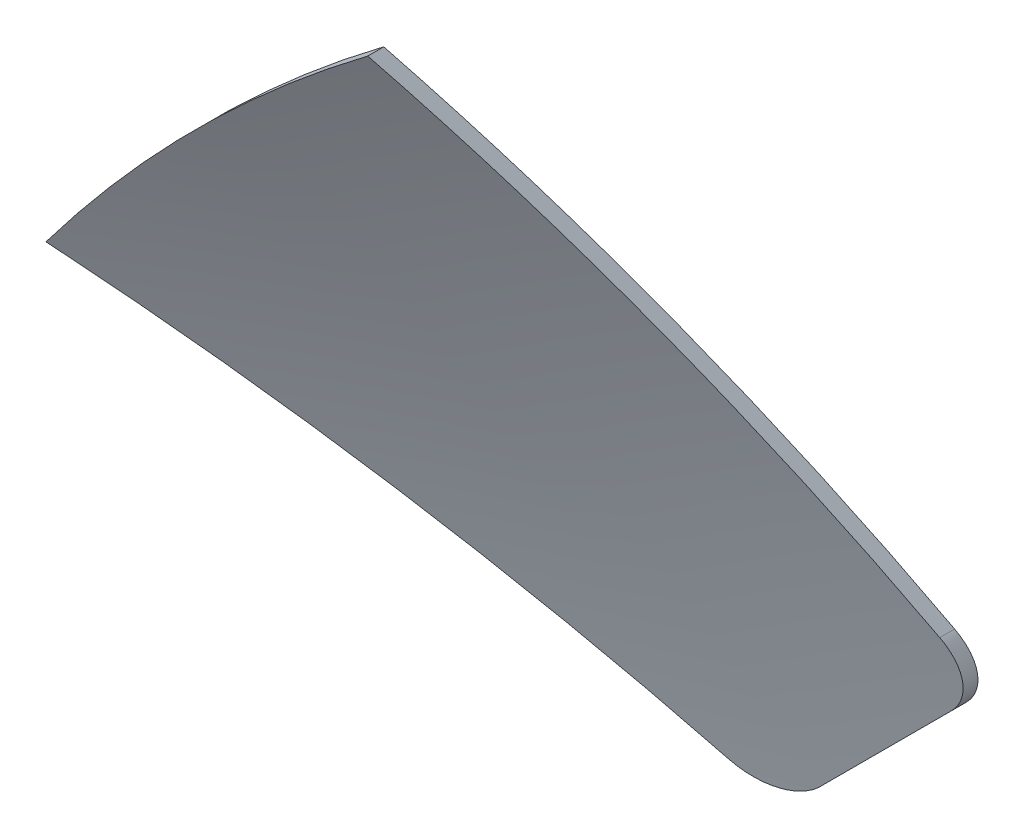
ISO-10303-21;
HEADER;
FILE_DESCRIPTION(('STEP AP214'),'2;1');
FILE_NAME('part.step','',(''),(''),'','','');
FILE_SCHEMA(('AUTOMOTIVE_DESIGN { 1 0 10303 214 1 1 1 1 }'));
ENDSEC;
DATA;
#1=APPLICATION_CONTEXT('core data for automotive mechanical design processes');
#2=APPLICATION_PROTOCOL_DEFINITION('international standard','automotive_design',2000,#1);
#3=PRODUCT_CONTEXT('',#1,'mechanical');
#4=PRODUCT('Part','Part','',(#3));
#5=PRODUCT_RELATED_PRODUCT_CATEGORY('part','',(#4));
#6=PRODUCT_DEFINITION_FORMATION('','',#4);
#7=PRODUCT_DEFINITION_CONTEXT('part definition',#1,'design');
#8=PRODUCT_DEFINITION('design','',#6,#7);
#9=PRODUCT_DEFINITION_SHAPE('','',#8);
#10=(LENGTH_UNIT() NAMED_UNIT(*) SI_UNIT(.MILLI.,.METRE.));
#11=(NAMED_UNIT(*) PLANE_ANGLE_UNIT() SI_UNIT($,.RADIAN.));
#12=(NAMED_UNIT(*) SI_UNIT($,.STERADIAN.) SOLID_ANGLE_UNIT());
#13=UNCERTAINTY_MEASURE_WITH_UNIT(LENGTH_MEASURE(1.E-05),#10,'distance_accuracy_value','');
#14=(GEOMETRIC_REPRESENTATION_CONTEXT(3) GLOBAL_UNCERTAINTY_ASSIGNED_CONTEXT((#13)) GLOBAL_UNIT_ASSIGNED_CONTEXT((#10,
#11,#12)) REPRESENTATION_CONTEXT('',''));
#15=CARTESIAN_POINT('',(0.,0.,0.));
#16=DIRECTION('',(0.,0.,1.));
#17=DIRECTION('',(1.,0.,0.));
#18=AXIS2_PLACEMENT_3D('',#15,#16,#17);
#19=CARTESIAN_POINT('',(0.,0.,0.));
#20=DIRECTION('',(0.,1.,0.));
#21=DIRECTION('',(-1.,0.,0.));
#22=AXIS2_PLACEMENT_3D('',#19,#20,#21);
#23=SPHERICAL_SURFACE('',#22,125.2);
#24=CARTESIAN_POINT('',(1.54509432030892E-13,2.05040941668107E-13,0.));
#25=DIRECTION('',(-0.601815023152046,-0.798635510047295,0.));
#26=DIRECTION('',(0.798635510047295,-0.601815023152046,0.));
#27=AXIS2_PLACEMENT_3D('',#24,#25,#26);
#28=CIRCLE('',#27,125.2);
#29=CARTESIAN_POINT('',(-30.080651327137,22.6673966372943,-119.400098598882));
#30=VERTEX_POINT('',#29);
#31=CARTESIAN_POINT('',(-45.9215418277184,34.6043638312421,-111.215061929579));
#32=VERTEX_POINT('',#31);
#33=EDGE_CURVE('E116',#30,#32,#28,.F.);
#34=ORIENTED_EDGE('',*,*,#33,.F.);
#35=CARTESIAN_POINT('',(-30.080651327137,22.6673966372943,-119.400098598882));
#36=CARTESIAN_POINT('',(-30.0342559521152,22.6324377051483,-119.418423791286));
#37=CARTESIAN_POINT('',(-29.9863495849535,22.599506208274,-119.436698131128));
#38=CARTESIAN_POINT('',(-29.8877929489192,22.5379010252209,-119.473036965783));
#39=CARTESIAN_POINT('',(-29.8371424794825,22.5092276508393,-119.491101445141));
#40=CARTESIAN_POINT('',(-29.6814650677244,22.4298872646997,-119.544826805092));
#41=CARTESIAN_POINT('',(-29.57274614365,22.3859256170709,-119.5800061719));
#42=CARTESIAN_POINT('',(-29.3485562182904,22.3175105085643,-119.648008338501));
#43=CARTESIAN_POINT('',(-29.2330787357613,22.2930761139132,-119.68082880671));
#44=CARTESIAN_POINT('',(-28.9987858189352,22.2649009719837,-119.743056026441));
#45=CARTESIAN_POINT('',(-28.8799733944071,22.2611421326881,-119.772465740453));
#46=CARTESIAN_POINT('',(-28.6457076141951,22.2747159838382,-119.826184873133));
#47=CARTESIAN_POINT('',(-28.5302482156375,22.2914957063134,-119.850608233489));
#48=CARTESIAN_POINT('',(-28.3030349642474,22.3452566406021,-119.894461086931));
#49=CARTESIAN_POINT('',(-28.1912811245729,22.3822379241396,-119.913890562286));
#50=CARTESIAN_POINT('',(-28.026076053361,22.4536434230641,-119.93922190616));
#51=CARTESIAN_POINT('',(-27.9698515527877,22.4811399468539,-119.947195588704));
#52=CARTESIAN_POINT('',(-27.8600426737283,22.5413943778651,-119.961441841549));
#53=CARTESIAN_POINT('',(-27.8064583996498,22.5741524929379,-119.967714344619));
#54=CARTESIAN_POINT('',(-27.7023096513323,22.6447836901815,-119.97849729452));
#55=CARTESIAN_POINT('',(-27.6517564973617,22.6826744094507,-119.983001447028));
#56=CARTESIAN_POINT('',(-27.5543656717481,22.7631399179549,-119.9901679599));
#57=CARTESIAN_POINT('',(-27.5075289114554,22.8057158500459,-119.992829869729));
#58=CARTESIAN_POINT('',(-27.4628077184598,22.8504540950158,-119.994545458827));
#59=B_SPLINE_CURVE_WITH_KNOTS('',3,(#35,#36,#37,#38,#39,#40,#41,#42,#43,#44,#45,#46,#47,#48,#49,
#50,#51,#52,#53,#54,#55,#56,#57,#58),.UNSPECIFIED.,.F.,.F.,(4,2,2,2,2,2,2,2,2,2,2,4),(0.,
0.182631789970604,0.36527694640453,0.730699579208949,1.09647857281522,1.46193744279103,
1.8177696898391,2.17360320025118,2.36263369180465,2.55167165256714,2.74137650935817,
2.93112774354191),.UNSPECIFIED.);
#60=CARTESIAN_POINT('',(-27.4628077184598,22.8504540950158,-119.994545458827));
#61=VERTEX_POINT('',#60);
#62=EDGE_CURVE('E150',#30,#61,#59,.T.);
#63=ORIENTED_EDGE('',*,*,#62,.T.);
#64=CARTESIAN_POINT('',(-25.1566309067385,25.1566309067372,0.));
#65=DIRECTION('',(0.707106781186566,-0.707106781186529,0.));
#66=DIRECTION('',(0.707106781186529,0.707106781186566,0.));
#67=AXIS2_PLACEMENT_3D('',#64,#65,#66);
#68=CIRCLE('',#67,120.03885971986);
#69=CARTESIAN_POINT('',(-22.8504540950161,27.4628077184598,-119.994545458827));
#70=VERTEX_POINT('',#69);
#71=EDGE_CURVE('E126',#70,#61,#68,.F.);
#72=ORIENTED_EDGE('',*,*,#71,.F.);
#73=CARTESIAN_POINT('',(-22.8504540950161,27.4628077184598,-119.994545458827));
#74=CARTESIAN_POINT('',(-22.8117392196671,27.5015212300685,-119.993057643808));
#75=CARTESIAN_POINT('',(-22.7746495915891,27.5417937143642,-119.990866022389));
#76=CARTESIAN_POINT('',(-22.7039411696911,27.6251737288177,-119.98509836884));
#77=CARTESIAN_POINT('',(-22.6703217572445,27.6682807514184,-119.981522584003));
#78=CARTESIAN_POINT('',(-22.5751711087436,27.8011831789781,-119.968778284154));
#79=CARTESIAN_POINT('',(-22.5191113469445,27.8947969116519,-119.957583546417));
#80=CARTESIAN_POINT('',(-22.4231712002449,28.0892025891152,-119.930188212258));
#81=CARTESIAN_POINT('',(-22.3832886200975,28.1899935577687,-119.913988295566));
#82=CARTESIAN_POINT('',(-22.3204067391179,28.3959398780183,-119.877111953839));
#83=CARTESIAN_POINT('',(-22.2974104404896,28.5010960021838,-119.856434733633));
#84=CARTESIAN_POINT('',(-22.2682055595662,28.7154190846117,-119.810701684102));
#85=CARTESIAN_POINT('',(-22.262408282479,28.8246220061184,-119.785553597188));
#86=CARTESIAN_POINT('',(-22.2685047692006,29.041756707713,-119.731961414446));
#87=CARTESIAN_POINT('',(-22.2804083230355,29.1496877510628,-119.703515502673));
#88=CARTESIAN_POINT('',(-22.3221830123231,29.3663959189616,-119.642754208868));
#89=CARTESIAN_POINT('',(-22.3528519509153,29.4749854700009,-119.610321285071));
#90=CARTESIAN_POINT('',(-22.4316805380676,29.6849204725533,-119.54362741489));
#91=CARTESIAN_POINT('',(-22.4798199751354,29.7862741337192,-119.509368619759));
#92=CARTESIAN_POINT('',(-22.555865778604,29.9170114209771,-119.462324957388));
#93=CARTESIAN_POINT('',(-22.5768374427042,29.9507092393145,-119.449919042236));
#94=CARTESIAN_POINT('',(-22.6206933166111,30.0167195115056,-119.425049722408));
#95=CARTESIAN_POINT('',(-22.6435740531503,30.0490343261252,-119.412586459497));
#96=CARTESIAN_POINT('',(-22.6673966372946,30.080651327137,-119.400098598882));
#97=B_SPLINE_CURVE_WITH_KNOTS('',3,(#73,#74,#75,#76,#77,#78,#79,#80,#81,#82,#83,#84,#85,#86,#87,
#88,#89,#90,#91,#92,#93,#94,#95,#96),.UNSPECIFIED.,.F.,.F.,(4,2,2,2,2,2,2,2,2,2,2,4),(0.,
0.164206082996275,0.328382842641972,0.655745552693463,0.98306382468505,1.31044027635533,
1.6455850633648,1.98091528216551,2.33160078916826,2.68188187725992,2.80658494478202,
2.93106588460728),.UNSPECIFIED.);
#98=CARTESIAN_POINT('',(-22.6673966372947,30.0806513271369,-119.400098598882));
#99=VERTEX_POINT('',#98);
#100=EDGE_CURVE('E140',#70,#99,#97,.T.);
#101=ORIENTED_EDGE('',*,*,#100,.T.);
#102=CARTESIAN_POINT('',(2.88165647749767E-13,2.17148390962342E-13,0.));
#103=DIRECTION('',(-0.798635510047279,-0.601815023152066,0.));
#104=DIRECTION('',(0.601815023152066,-0.798635510047279,0.));
#105=AXIS2_PLACEMENT_3D('',#102,#103,#104);
#106=CIRCLE('',#105,125.2);
#107=CARTESIAN_POINT('',(-34.6043638312428,45.9215418277178,-111.215061929579));
#108=VERTEX_POINT('',#107);
#109=EDGE_CURVE('E138',#99,#108,#106,.F.);
#110=ORIENTED_EDGE('',*,*,#109,.T.);
#111=CARTESIAN_POINT('',(0.,0.,-111.215061929579));
#112=DIRECTION('',(0.,0.,1.));
#113=DIRECTION('',(1.,0.,0.));
#114=AXIS2_PLACEMENT_3D('',#111,#112,#113);
#115=CIRCLE('',#114,57.4999999999988);
#116=EDGE_CURVE('E133',#32,#108,#115,.F.);
#117=ORIENTED_EDGE('',*,*,#116,.F.);
#118=EDGE_LOOP('',(#34,#63,#72,#101,#110,#117));
#119=FACE_BOUND('',#118,.T.);
#120=ADVANCED_FACE('F60',(#119),#23,.F.);
#121=CARTESIAN_POINT('',(0.,0.,-323.));
#122=DIRECTION('',(0.,0.,1.));
#123=DIRECTION('',(1.,0.,0.));
#124=AXIS2_PLACEMENT_3D('',#121,#122,#123);
#125=CYLINDRICAL_SURFACE('',#124,57.4999999999988);
#126=DIRECTION('',(0.,0.,1.));
#127=VECTOR('',#126,1.);
#128=CARTESIAN_POINT('',(-45.9215418277184,34.6043638312421,-323.));
#129=LINE('',#128,#127);
#130=CARTESIAN_POINT('',(-45.9215418277184,34.6043638312421,-111.777636403711));
#131=VERTEX_POINT('',#130);
#132=EDGE_CURVE('E120',#131,#32,#129,.T.);
#133=ORIENTED_EDGE('',*,*,#132,.T.);
#134=ORIENTED_EDGE('',*,*,#116,.T.);
#135=DIRECTION('',(0.,0.,1.));
#136=VECTOR('',#135,1.);
#137=CARTESIAN_POINT('',(-34.6043638312428,45.9215418277178,-323.));
#138=LINE('',#137,#136);
#139=CARTESIAN_POINT('',(-34.6043638312428,45.9215418277178,-111.777636403711));
#140=VERTEX_POINT('',#139);
#141=EDGE_CURVE('E136',#140,#108,#138,.T.);
#142=ORIENTED_EDGE('',*,*,#141,.F.);
#143=CARTESIAN_POINT('',(0.,0.,-111.777636403711));
#144=DIRECTION('',(0.,0.,1.));
#145=DIRECTION('',(1.,0.,0.));
#146=AXIS2_PLACEMENT_3D('',#143,#144,#145);
#147=CIRCLE('',#146,57.4999999999988);
#148=EDGE_CURVE('E127',#131,#140,#147,.F.);
#149=ORIENTED_EDGE('',*,*,#148,.F.);
#150=EDGE_LOOP('',(#133,#134,#142,#149));
#151=FACE_BOUND('',#150,.T.);
#152=ADVANCED_FACE('F131',(#151),#125,.T.);
#153=CARTESIAN_POINT('',(-34.6043638312428,45.9215418277178,-323.));
#154=DIRECTION('',(-0.798635510047279,-0.601815023152066,0.));
#155=DIRECTION('',(0.601815023152066,-0.798635510047279,0.));
#156=AXIS2_PLACEMENT_3D('',#153,#154,#155);
#157=PLANE('',#156);
#158=ORIENTED_EDGE('',*,*,#109,.F.);
#159=DIRECTION('',(0.,0.,1.));
#160=VECTOR('',#159,1.);
#161=CARTESIAN_POINT('',(-22.6673966372947,30.0806513271369,-120.456539228239));
#162=LINE('',#161,#160);
#163=CARTESIAN_POINT('',(-22.6673966372947,30.0806513271369,-119.924282551211));
#164=VERTEX_POINT('',#163);
#165=EDGE_CURVE('E13',#99,#164,#162,.F.);
#166=ORIENTED_EDGE('',*,*,#165,.T.);
#167=CARTESIAN_POINT('',(2.88165647749767E-13,2.17148390962342E-13,0.));
#168=DIRECTION('',(-0.798635510047279,-0.601815023152066,0.));
#169=DIRECTION('',(0.601815023152066,-0.798635510047279,0.));
#170=AXIS2_PLACEMENT_3D('',#167,#168,#169);
#171=CIRCLE('',#170,125.7);
#172=EDGE_CURVE('E193',#164,#140,#171,.F.);
#173=ORIENTED_EDGE('',*,*,#172,.T.);
#174=ORIENTED_EDGE('',*,*,#141,.T.);
#175=EDGE_LOOP('',(#158,#166,#173,#174));
#176=FACE_BOUND('',#175,.T.);
#177=ADVANCED_FACE('F192',(#176),#157,.F.);
#178=CARTESIAN_POINT('',(-28.6921648126706,21.621097000805,-323.));
#179=DIRECTION('',(0.707106781186566,-0.707106781186529,0.));
#180=DIRECTION('',(0.707106781186529,0.707106781186566,0.));
#181=AXIS2_PLACEMENT_3D('',#178,#179,#180);
#182=PLANE('',#181);
#183=ORIENTED_EDGE('',*,*,#71,.T.);
#184=DIRECTION('',(0.,0.,1.));
#185=VECTOR('',#184,1.);
#186=CARTESIAN_POINT('',(-27.4628077184598,22.8504540950158,-323.));
#187=LINE('',#186,#185);
#188=CARTESIAN_POINT('',(-27.4628077184598,22.8504540950158,-120.516143897282));
#189=VERTEX_POINT('',#188);
#190=EDGE_CURVE('E82',#61,#189,#187,.F.);
#191=ORIENTED_EDGE('',*,*,#190,.T.);
#192=CARTESIAN_POINT('',(-25.1566309067385,25.1566309067372,0.));
#193=DIRECTION('',(0.707106781186566,-0.707106781186529,0.));
#194=DIRECTION('',(0.707106781186529,0.707106781186566,0.));
#195=AXIS2_PLACEMENT_3D('',#192,#193,#194);
#196=CIRCLE('',#195,120.56026643486);
#197=CARTESIAN_POINT('',(-22.8504540950161,27.4628077184598,-120.516143897282));
#198=VERTEX_POINT('',#197);
#199=EDGE_CURVE('E196',#198,#189,#196,.F.);
#200=ORIENTED_EDGE('',*,*,#199,.F.);
#201=DIRECTION('',(0.,0.,1.));
#202=VECTOR('',#201,1.);
#203=CARTESIAN_POINT('',(-22.8504540950161,27.4628077184598,-119.934681568112));
#204=LINE('',#203,#202);
#205=EDGE_CURVE('E179',#198,#70,#204,.T.);
#206=ORIENTED_EDGE('',*,*,#205,.T.);
#207=EDGE_LOOP('',(#183,#191,#200,#206));
#208=FACE_BOUND('',#207,.T.);
#209=ADVANCED_FACE('F184',(#208),#182,.T.);
#210=CARTESIAN_POINT('',(-45.9215418277184,34.6043638312421,-323.));
#211=DIRECTION('',(-0.601815023152046,-0.798635510047295,0.));
#212=DIRECTION('',(0.798635510047295,-0.601815023152046,0.));
#213=AXIS2_PLACEMENT_3D('',#210,#211,#212);
#214=PLANE('',#213);
#215=CARTESIAN_POINT('',(1.54509432030892E-13,2.05040941668107E-13,0.));
#216=DIRECTION('',(-0.601815023152046,-0.798635510047295,0.));
#217=DIRECTION('',(0.798635510047295,-0.601815023152046,0.));
#218=AXIS2_PLACEMENT_3D('',#215,#216,#217);
#219=CIRCLE('',#218,125.7);
#220=CARTESIAN_POINT('',(-30.080651327137,22.6673966372943,-119.924282551211));
#221=VERTEX_POINT('',#220);
#222=EDGE_CURVE('E194',#221,#131,#219,.F.);
#223=ORIENTED_EDGE('',*,*,#222,.F.);
#224=DIRECTION('',(0.,0.,1.));
#225=VECTOR('',#224,1.);
#226=CARTESIAN_POINT('',(-30.080651327137,22.6673966372943,-323.));
#227=LINE('',#226,#225);
#228=EDGE_CURVE('E123',#221,#30,#227,.T.);
#229=ORIENTED_EDGE('',*,*,#228,.T.);
#230=ORIENTED_EDGE('',*,*,#33,.T.);
#231=ORIENTED_EDGE('',*,*,#132,.F.);
#232=EDGE_LOOP('',(#223,#229,#230,#231));
#233=FACE_BOUND('',#232,.T.);
#234=ADVANCED_FACE('F119',(#233),#214,.T.);
#235=CARTESIAN_POINT('',(0.,0.,0.));
#236=DIRECTION('',(0.,1.,0.));
#237=DIRECTION('',(-1.,0.,0.));
#238=AXIS2_PLACEMENT_3D('',#235,#236,#237);
#239=SPHERICAL_SURFACE('',#238,125.7);
#240=ORIENTED_EDGE('',*,*,#199,.T.);
#241=CARTESIAN_POINT('',(-27.4628077184598,22.8504540950158,-120.516143897282));
#242=CARTESIAN_POINT('',(-27.5015298162933,22.8117306480653,-120.514662190182));
#243=CARTESIAN_POINT('',(-27.5418116928819,22.7746330226399,-120.512479413928));
#244=CARTESIAN_POINT('',(-27.6252122570293,22.7039098210229,-120.506734777257));
#245=CARTESIAN_POINT('',(-27.6683304398109,22.6702836297426,-120.503173161685));
#246=CARTESIAN_POINT('',(-27.8012700317255,22.5751140084663,-120.490478949));
#247=CARTESIAN_POINT('',(-27.8949126158211,22.5190442469466,-120.479327781883));
#248=CARTESIAN_POINT('',(-28.0893843079871,22.4230915511641,-120.452037813895));
#249=CARTESIAN_POINT('',(-28.1902124757969,22.3832065036264,-120.43589966467));
#250=CARTESIAN_POINT('',(-28.3962398800479,22.3203304486096,-120.399162554536));
#251=CARTESIAN_POINT('',(-28.5014398746295,22.2973423843464,-120.378562817289));
#252=CARTESIAN_POINT('',(-28.7158365648439,22.2681704539478,-120.333003894877));
#253=CARTESIAN_POINT('',(-28.8250690466466,22.2623949256924,-120.307953497845));
#254=CARTESIAN_POINT('',(-29.0422648956311,22.2685450774426,-120.254568614115));
#255=CARTESIAN_POINT('',(-29.1502275269448,22.2804805561793,-120.226232317469));
#256=CARTESIAN_POINT('',(-29.3669593711839,22.3223250849677,-120.165715536003));
#257=CARTESIAN_POINT('',(-29.4755424576497,22.3530259415095,-120.133418900042));
#258=CARTESIAN_POINT('',(-29.6854629938885,22.4319195061731,-120.067005944263));
#259=CARTESIAN_POINT('',(-29.7868086933237,22.4800919054563,-120.032891776254));
#260=CARTESIAN_POINT('',(-29.917441890443,22.5561302031672,-119.98607997772));
#261=CARTESIAN_POINT('',(-29.9510487472147,22.5770558408833,-119.973759424281));
#262=CARTESIAN_POINT('',(-30.0168840106575,22.620809795628,-119.949061463364));
#263=CARTESIAN_POINT('',(-30.0491147625878,22.6436346625737,-119.936684195972));
#264=CARTESIAN_POINT('',(-30.080651327137,22.6673966372943,-119.924282551211));
#265=B_SPLINE_CURVE_WITH_KNOTS('',3,(#241,#242,#243,#244,#245,#246,#247,#248,#249,#250,#251,
#252,#253,#254,#255,#256,#257,#258,#259,#260,#261,#262,#263,#264),.UNSPECIFIED.,.F.,.F.,(4,2,2,
2,2,2,2,2,2,2,2,4),(0.,0.164241982552949,0.328454813638015,0.655893158273955,0.983288734772132,
1.31074132544921,1.64590267448632,1.98124952289076,2.33182920495376,2.68200267409795,
2.80633910576152,2.93045440642632),.UNSPECIFIED.);
#266=EDGE_CURVE('E69',#189,#221,#265,.T.);
#267=ORIENTED_EDGE('',*,*,#266,.T.);
#268=ORIENTED_EDGE('',*,*,#222,.T.);
#269=ORIENTED_EDGE('',*,*,#148,.T.);
#270=ORIENTED_EDGE('',*,*,#172,.F.);
#271=CARTESIAN_POINT('',(-22.6673966372947,30.0806513271369,-119.924282551211));
#272=CARTESIAN_POINT('',(-22.6324474111948,30.0342688563514,-119.942522573662));
#273=CARTESIAN_POINT('',(-22.599524594817,29.9863763224039,-119.960711989037));
#274=CARTESIAN_POINT('',(-22.5379345963145,29.8878493357341,-119.996881930415));
#275=CARTESIAN_POINT('',(-22.5092677214442,29.8372146854068,-120.01486244125));
#276=CARTESIAN_POINT('',(-22.4299440119245,29.6815892057271,-120.068337544049));
#277=CARTESIAN_POINT('',(-22.3859887245396,29.5729095489788,-120.103352848599));
#278=CARTESIAN_POINT('',(-22.3175737823034,29.3488069691428,-120.171037842147));
#279=CARTESIAN_POINT('',(-22.2931330871301,29.2333776048223,-120.20370522202));
#280=CARTESIAN_POINT('',(-22.2649283405676,28.9991874250842,-120.265643202984));
#281=CARTESIAN_POINT('',(-22.2611462784078,28.8804296023463,-120.294916741117));
#282=CARTESIAN_POINT('',(-22.2746551252457,28.6462457389178,-120.348396124322));
#283=CARTESIAN_POINT('',(-22.2913985967962,28.5308136390066,-120.37271429633));
#284=CARTESIAN_POINT('',(-22.3450738381352,28.3036536951308,-120.416381494872));
#285=CARTESIAN_POINT('',(-22.3820058252127,28.1919258910494,-120.43573046792));
#286=CARTESIAN_POINT('',(-22.4533591299741,28.0266767745392,-120.460973155352));
#287=CARTESIAN_POINT('',(-22.4808651594776,27.9703877605126,-120.468925853975));
#288=CARTESIAN_POINT('',(-22.5411489337696,27.8604549029339,-120.483134221224));
#289=CARTESIAN_POINT('',(-22.5739268970717,27.806811169145,-120.489389819479));
#290=CARTESIAN_POINT('',(-22.6446073006229,27.7025496773682,-120.500143196934));
#291=CARTESIAN_POINT('',(-22.682527402722,27.6519432562276,-120.504634700121));
#292=CARTESIAN_POINT('',(-22.763060221591,27.5544532963032,-120.511780394793));
#293=CARTESIAN_POINT('',(-22.8056740717761,27.5075706614392,-120.514434141377));
#294=CARTESIAN_POINT('',(-22.8504540950161,27.4628077184598,-120.516143897282));
#295=B_SPLINE_CURVE_WITH_KNOTS('',3,(#271,#272,#273,#274,#275,#276,#277,#278,#279,#280,#281,
#282,#283,#284,#285,#286,#287,#288,#289,#290,#291,#292,#293,#294),.UNSPECIFIED.,.F.,.F.,(4,2,2,
2,2,2,2,2,2,2,2,4),(0.,0.18250891943989,0.36503100856612,0.730202320248031,1.09572798903309,
1.460934931456,1.8166098103598,2.17228851746849,2.36149527870891,2.55070988429735,
2.74059167845181,2.93051942494211),.UNSPECIFIED.);
#296=EDGE_CURVE('E169',#164,#198,#295,.T.);
#297=ORIENTED_EDGE('',*,*,#296,.T.);
#298=EDGE_LOOP('',(#240,#267,#268,#269,#270,#297));
#299=FACE_BOUND('',#298,.T.);
#300=ADVANCED_FACE('F160',(#299),#239,.T.);
#301=CARTESIAN_POINT('',(-28.8770212808329,24.2646676573889,-323.));
#302=DIRECTION('',(0.,0.,1.));
#303=DIRECTION('',(1.,0.,0.));
#304=AXIS2_PLACEMENT_3D('',#301,#302,#303);
#305=CYLINDRICAL_SURFACE('',#304,2.);
#306=ORIENTED_EDGE('',*,*,#266,.F.);
#307=ORIENTED_EDGE('',*,*,#190,.F.);
#308=ORIENTED_EDGE('',*,*,#62,.F.);
#309=ORIENTED_EDGE('',*,*,#228,.F.);
#310=EDGE_LOOP('',(#306,#307,#308,#309));
#311=FACE_BOUND('',#310,.T.);
#312=ADVANCED_FACE('F164',(#311),#305,.T.);
#313=CARTESIAN_POINT('',(-24.2646676573892,28.8770212808328,-323.));
#314=DIRECTION('',(0.,0.,-1.));
#315=DIRECTION('',(-1.,0.,0.));
#316=AXIS2_PLACEMENT_3D('',#313,#314,#315);
#317=CYLINDRICAL_SURFACE('',#316,2.);
#318=ORIENTED_EDGE('',*,*,#296,.F.);
#319=ORIENTED_EDGE('',*,*,#165,.F.);
#320=ORIENTED_EDGE('',*,*,#100,.F.);
#321=ORIENTED_EDGE('',*,*,#205,.F.);
#322=EDGE_LOOP('',(#318,#319,#320,#321));
#323=FACE_BOUND('',#322,.T.);
#324=ADVANCED_FACE('F62',(#323),#317,.T.);
#325=CLOSED_SHELL('',(#120,#152,#177,#209,#234,#300,#312,#324));
#326=MANIFOLD_SOLID_BREP('B2',#325);
#327=ADVANCED_BREP_SHAPE_REPRESENTATION('',(#18,#326),#14);
#328=SHAPE_DEFINITION_REPRESENTATION(#9,#327);
ENDSEC;
END-ISO-10303-21;
